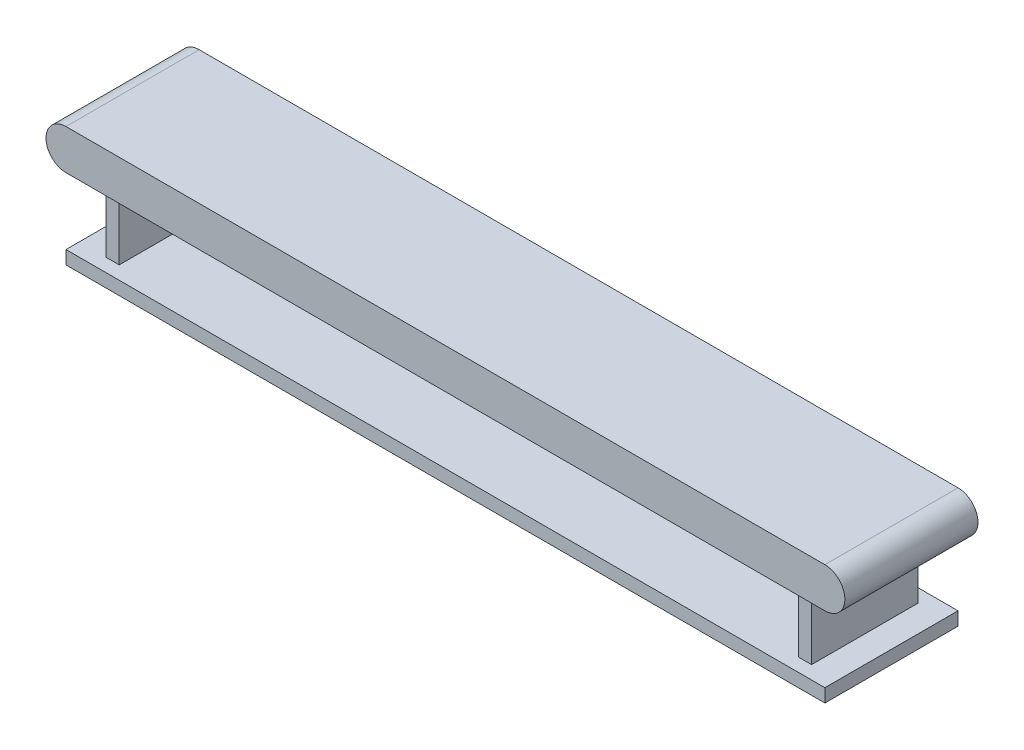
ISO-10303-21;
HEADER;
FILE_DESCRIPTION(('STEP AP214'),'2;1');
FILE_NAME('part.step','',(''),(''),'','','');
FILE_SCHEMA(('AUTOMOTIVE_DESIGN { 1 0 10303 214 1 1 1 1 }'));
ENDSEC;
DATA;
#1=APPLICATION_CONTEXT('core data for automotive mechanical design processes');
#2=APPLICATION_PROTOCOL_DEFINITION('international standard','automotive_design',2000,#1);
#3=PRODUCT_CONTEXT('',#1,'mechanical');
#4=PRODUCT('Part','Part','',(#3));
#5=PRODUCT_RELATED_PRODUCT_CATEGORY('part','',(#4));
#6=PRODUCT_DEFINITION_FORMATION('','',#4);
#7=PRODUCT_DEFINITION_CONTEXT('part definition',#1,'design');
#8=PRODUCT_DEFINITION('design','',#6,#7);
#9=PRODUCT_DEFINITION_SHAPE('','',#8);
#10=(LENGTH_UNIT() NAMED_UNIT(*) SI_UNIT(.MILLI.,.METRE.));
#11=(NAMED_UNIT(*) PLANE_ANGLE_UNIT() SI_UNIT($,.RADIAN.));
#12=(NAMED_UNIT(*) SI_UNIT($,.STERADIAN.) SOLID_ANGLE_UNIT());
#13=UNCERTAINTY_MEASURE_WITH_UNIT(LENGTH_MEASURE(1.E-05),#10,'distance_accuracy_value','');
#14=(GEOMETRIC_REPRESENTATION_CONTEXT(3) GLOBAL_UNCERTAINTY_ASSIGNED_CONTEXT((#13)) GLOBAL_UNIT_ASSIGNED_CONTEXT((#10,
#11,#12)) REPRESENTATION_CONTEXT('',''));
#15=CARTESIAN_POINT('',(0.,0.,0.));
#16=DIRECTION('',(0.,0.,1.));
#17=DIRECTION('',(1.,0.,0.));
#18=AXIS2_PLACEMENT_3D('',#15,#16,#17);
#19=CARTESIAN_POINT('',(0.,0.,0.));
#20=DIRECTION('',(0.,-1.,0.));
#21=DIRECTION('',(0.,0.,-1.));
#22=AXIS2_PLACEMENT_3D('',#19,#20,#21);
#23=PLANE('',#22);
#24=DIRECTION('',(1.,0.,0.));
#25=VECTOR('',#24,1.);
#26=CARTESIAN_POINT('',(-2650.,0.,400.));
#27=LINE('',#26,#25);
#28=CARTESIAN_POINT('',(-2650.,0.,400.));
#29=VERTEX_POINT('',#28);
#30=CARTESIAN_POINT('',(-2550.,0.,400.));
#31=VERTEX_POINT('',#30);
#32=EDGE_CURVE('E231',#29,#31,#27,.T.);
#33=ORIENTED_EDGE('',*,*,#32,.T.);
#34=DIRECTION('',(0.,0.,1.));
#35=VECTOR('',#34,1.);
#36=CARTESIAN_POINT('',(-2550.,0.,-400.));
#37=LINE('',#36,#35);
#38=CARTESIAN_POINT('',(-2550.,0.,-400.));
#39=VERTEX_POINT('',#38);
#40=EDGE_CURVE('E255',#39,#31,#37,.T.);
#41=ORIENTED_EDGE('',*,*,#40,.F.);
#42=DIRECTION('',(1.,0.,0.));
#43=VECTOR('',#42,1.);
#44=CARTESIAN_POINT('',(-2650.,0.,-400.));
#45=LINE('',#44,#43);
#46=CARTESIAN_POINT('',(-2650.,0.,-400.));
#47=VERTEX_POINT('',#46);
#48=EDGE_CURVE('E258',#47,#39,#45,.T.);
#49=ORIENTED_EDGE('',*,*,#48,.F.);
#50=DIRECTION('',(0.,0.,1.));
#51=VECTOR('',#50,1.);
#52=CARTESIAN_POINT('',(-2650.,0.,-400.));
#53=LINE('',#52,#51);
#54=EDGE_CURVE('E243',#47,#29,#53,.T.);
#55=ORIENTED_EDGE('',*,*,#54,.T.);
#56=EDGE_LOOP('',(#33,#41,#49,#55));
#57=FACE_BOUND('',#56,.T.);
#58=DIRECTION('',(-1.,0.,0.));
#59=VECTOR('',#58,1.);
#60=CARTESIAN_POINT('',(-3000.,0.,-500.));
#61=LINE('',#60,#59);
#62=CARTESIAN_POINT('',(2850.,0.,-500.));
#63=VERTEX_POINT('',#62);
#64=CARTESIAN_POINT('',(-2850.,0.,-500.));
#65=VERTEX_POINT('',#64);
#66=EDGE_CURVE('E286',#63,#65,#61,.T.);
#67=ORIENTED_EDGE('',*,*,#66,.F.);
#68=DIRECTION('',(0.,0.,1.));
#69=VECTOR('',#68,1.);
#70=CARTESIAN_POINT('',(2850.,0.,-500.));
#71=LINE('',#70,#69);
#72=CARTESIAN_POINT('',(2850.,0.,500.));
#73=VERTEX_POINT('',#72);
#74=EDGE_CURVE('E271',#63,#73,#71,.T.);
#75=ORIENTED_EDGE('',*,*,#74,.T.);
#76=DIRECTION('',(1.,0.,0.));
#77=VECTOR('',#76,1.);
#78=CARTESIAN_POINT('',(-3000.,0.,500.));
#79=LINE('',#78,#77);
#80=CARTESIAN_POINT('',(-2850.,0.,500.));
#81=VERTEX_POINT('',#80);
#82=EDGE_CURVE('E73',#81,#73,#79,.T.);
#83=ORIENTED_EDGE('',*,*,#82,.F.);
#84=DIRECTION('',(0.,0.,1.));
#85=VECTOR('',#84,1.);
#86=CARTESIAN_POINT('',(-2850.,0.,-500.));
#87=LINE('',#86,#85);
#88=EDGE_CURVE('E283',#65,#81,#87,.T.);
#89=ORIENTED_EDGE('',*,*,#88,.F.);
#90=EDGE_LOOP('',(#67,#75,#83,#89));
#91=FACE_BOUND('',#90,.T.);
#92=DIRECTION('',(-1.,0.,0.));
#93=VECTOR('',#92,1.);
#94=CARTESIAN_POINT('',(2650.,0.,400.));
#95=LINE('',#94,#93);
#96=CARTESIAN_POINT('',(2650.,0.,400.));
#97=VERTEX_POINT('',#96);
#98=CARTESIAN_POINT('',(2550.,0.,400.));
#99=VERTEX_POINT('',#98);
#100=EDGE_CURVE('E86',#97,#99,#95,.T.);
#101=ORIENTED_EDGE('',*,*,#100,.F.);
#102=DIRECTION('',(0.,0.,1.));
#103=VECTOR('',#102,1.);
#104=CARTESIAN_POINT('',(2650.,0.,-400.));
#105=LINE('',#104,#103);
#106=CARTESIAN_POINT('',(2650.,0.,-400.));
#107=VERTEX_POINT('',#106);
#108=EDGE_CURVE('E228',#107,#97,#105,.T.);
#109=ORIENTED_EDGE('',*,*,#108,.F.);
#110=DIRECTION('',(-1.,0.,0.));
#111=VECTOR('',#110,1.);
#112=CARTESIAN_POINT('',(2650.,0.,-400.));
#113=LINE('',#112,#111);
#114=CARTESIAN_POINT('',(2550.,0.,-400.));
#115=VERTEX_POINT('',#114);
#116=EDGE_CURVE('E223',#107,#115,#113,.T.);
#117=ORIENTED_EDGE('',*,*,#116,.T.);
#118=DIRECTION('',(0.,0.,1.));
#119=VECTOR('',#118,1.);
#120=CARTESIAN_POINT('',(2550.,0.,-400.));
#121=LINE('',#120,#119);
#122=EDGE_CURVE('E91',#115,#99,#121,.T.);
#123=ORIENTED_EDGE('',*,*,#122,.T.);
#124=EDGE_LOOP('',(#101,#109,#117,#123));
#125=FACE_BOUND('',#124,.T.);
#126=ADVANCED_FACE('F69',(#57,#91,#125),#23,.T.);
#127=CARTESIAN_POINT('',(-3000.,300.,-500.));
#128=DIRECTION('',(0.,0.,1.));
#129=DIRECTION('',(1.,0.,0.));
#130=AXIS2_PLACEMENT_3D('',#127,#128,#129);
#131=PLANE('',#130);
#132=CARTESIAN_POINT('',(2850.,150.,-500.));
#133=DIRECTION('',(0.,0.,1.));
#134=DIRECTION('',(1.,0.,0.));
#135=AXIS2_PLACEMENT_3D('',#132,#133,#134);
#136=CIRCLE('',#135,150.);
#137=CARTESIAN_POINT('',(2850.,300.,-500.));
#138=VERTEX_POINT('',#137);
#139=EDGE_CURVE('E277',#63,#138,#136,.T.);
#140=ORIENTED_EDGE('',*,*,#139,.F.);
#141=ORIENTED_EDGE('',*,*,#66,.T.);
#142=CARTESIAN_POINT('',(-2850.,150.,-500.));
#143=DIRECTION('',(0.,0.,1.));
#144=DIRECTION('',(1.,0.,0.));
#145=AXIS2_PLACEMENT_3D('',#142,#143,#144);
#146=CIRCLE('',#145,150.);
#147=CARTESIAN_POINT('',(-2850.,300.,-500.));
#148=VERTEX_POINT('',#147);
#149=EDGE_CURVE('E287',#148,#65,#146,.T.);
#150=ORIENTED_EDGE('',*,*,#149,.F.);
#151=DIRECTION('',(-1.,0.,0.));
#152=VECTOR('',#151,1.);
#153=CARTESIAN_POINT('',(-3000.,300.,-500.));
#154=LINE('',#153,#152);
#155=EDGE_CURVE('E78',#138,#148,#154,.T.);
#156=ORIENTED_EDGE('',*,*,#155,.F.);
#157=EDGE_LOOP('',(#140,#141,#150,#156));
#158=FACE_BOUND('',#157,.T.);
#159=ADVANCED_FACE('F71',(#158),#131,.F.);
#160=CARTESIAN_POINT('',(-3000.,300.,500.));
#161=DIRECTION('',(0.,0.,-1.));
#162=DIRECTION('',(-1.,0.,0.));
#163=AXIS2_PLACEMENT_3D('',#160,#161,#162);
#164=PLANE('',#163);
#165=ORIENTED_EDGE('',*,*,#82,.T.);
#166=CARTESIAN_POINT('',(2850.,150.,500.));
#167=DIRECTION('',(0.,0.,1.));
#168=DIRECTION('',(1.,0.,0.));
#169=AXIS2_PLACEMENT_3D('',#166,#167,#168);
#170=CIRCLE('',#169,150.);
#171=CARTESIAN_POINT('',(2850.,300.,500.));
#172=VERTEX_POINT('',#171);
#173=EDGE_CURVE('E280',#73,#172,#170,.T.);
#174=ORIENTED_EDGE('',*,*,#173,.T.);
#175=DIRECTION('',(1.,0.,0.));
#176=VECTOR('',#175,1.);
#177=CARTESIAN_POINT('',(-3000.,300.,500.));
#178=LINE('',#177,#176);
#179=CARTESIAN_POINT('',(-2850.,300.,500.));
#180=VERTEX_POINT('',#179);
#181=EDGE_CURVE('E12',#180,#172,#178,.T.);
#182=ORIENTED_EDGE('',*,*,#181,.F.);
#183=CARTESIAN_POINT('',(-2850.,150.,500.));
#184=DIRECTION('',(0.,0.,1.));
#185=DIRECTION('',(1.,0.,0.));
#186=AXIS2_PLACEMENT_3D('',#183,#184,#185);
#187=CIRCLE('',#186,150.);
#188=EDGE_CURVE('E274',#180,#81,#187,.T.);
#189=ORIENTED_EDGE('',*,*,#188,.T.);
#190=EDGE_LOOP('',(#165,#174,#182,#189));
#191=FACE_BOUND('',#190,.T.);
#192=ADVANCED_FACE('F299',(#191),#164,.F.);
#193=CARTESIAN_POINT('',(0.,300.,0.));
#194=DIRECTION('',(0.,-1.,0.));
#195=DIRECTION('',(0.,0.,-1.));
#196=AXIS2_PLACEMENT_3D('',#193,#194,#195);
#197=PLANE('',#196);
#198=ORIENTED_EDGE('',*,*,#155,.T.);
#199=DIRECTION('',(0.,0.,1.));
#200=VECTOR('',#199,1.);
#201=CARTESIAN_POINT('',(-2850.,300.,-500.));
#202=LINE('',#201,#200);
#203=EDGE_CURVE('E265',#148,#180,#202,.T.);
#204=ORIENTED_EDGE('',*,*,#203,.T.);
#205=ORIENTED_EDGE('',*,*,#181,.T.);
#206=DIRECTION('',(0.,0.,1.));
#207=VECTOR('',#206,1.);
#208=CARTESIAN_POINT('',(2850.,300.,-500.));
#209=LINE('',#208,#207);
#210=EDGE_CURVE('E279',#138,#172,#209,.T.);
#211=ORIENTED_EDGE('',*,*,#210,.F.);
#212=EDGE_LOOP('',(#198,#204,#205,#211));
#213=FACE_BOUND('',#212,.T.);
#214=ADVANCED_FACE('F309',(#213),#197,.F.);
#215=CARTESIAN_POINT('',(-2850.,150.,-500.));
#216=DIRECTION('',(0.,0.,1.));
#217=DIRECTION('',(1.,0.,0.));
#218=AXIS2_PLACEMENT_3D('',#215,#216,#217);
#219=CYLINDRICAL_SURFACE('',#218,150.);
#220=ORIENTED_EDGE('',*,*,#188,.F.);
#221=ORIENTED_EDGE('',*,*,#203,.F.);
#222=ORIENTED_EDGE('',*,*,#149,.T.);
#223=ORIENTED_EDGE('',*,*,#88,.T.);
#224=EDGE_LOOP('',(#220,#221,#222,#223));
#225=FACE_BOUND('',#224,.T.);
#226=ADVANCED_FACE('F312',(#225),#219,.T.);
#227=CARTESIAN_POINT('',(2850.,150.,-500.));
#228=DIRECTION('',(0.,0.,1.));
#229=DIRECTION('',(1.,0.,0.));
#230=AXIS2_PLACEMENT_3D('',#227,#228,#229);
#231=CYLINDRICAL_SURFACE('',#230,150.);
#232=ORIENTED_EDGE('',*,*,#173,.F.);
#233=ORIENTED_EDGE('',*,*,#74,.F.);
#234=ORIENTED_EDGE('',*,*,#139,.T.);
#235=ORIENTED_EDGE('',*,*,#210,.T.);
#236=EDGE_LOOP('',(#232,#233,#234,#235));
#237=FACE_BOUND('',#236,.T.);
#238=ADVANCED_FACE('F305',(#237),#231,.T.);
#239=CARTESIAN_POINT('',(-2650.,-500.,400.));
#240=DIRECTION('',(0.,0.,1.));
#241=DIRECTION('',(1.,0.,0.));
#242=AXIS2_PLACEMENT_3D('',#239,#240,#241);
#243=PLANE('',#242);
#244=ORIENTED_EDGE('',*,*,#32,.F.);
#245=DIRECTION('',(0.,1.,0.));
#246=VECTOR('',#245,1.);
#247=CARTESIAN_POINT('',(-2650.,-500.,400.));
#248=LINE('',#247,#246);
#249=CARTESIAN_POINT('',(-2650.,-500.,400.));
#250=VERTEX_POINT('',#249);
#251=EDGE_CURVE('E263',#250,#29,#248,.T.);
#252=ORIENTED_EDGE('',*,*,#251,.F.);
#253=DIRECTION('',(1.,0.,0.));
#254=VECTOR('',#253,1.);
#255=CARTESIAN_POINT('',(-2650.,-500.,400.));
#256=LINE('',#255,#254);
#257=CARTESIAN_POINT('',(-2550.,-500.,400.));
#258=VERTEX_POINT('',#257);
#259=EDGE_CURVE('E240',#250,#258,#256,.T.);
#260=ORIENTED_EDGE('',*,*,#259,.T.);
#261=DIRECTION('',(0.,1.,0.));
#262=VECTOR('',#261,1.);
#263=CARTESIAN_POINT('',(-2550.,-500.,400.));
#264=LINE('',#263,#262);
#265=EDGE_CURVE('E252',#258,#31,#264,.T.);
#266=ORIENTED_EDGE('',*,*,#265,.T.);
#267=EDGE_LOOP('',(#244,#252,#260,#266));
#268=FACE_BOUND('',#267,.T.);
#269=ADVANCED_FACE('F319',(#268),#243,.T.);
#270=CARTESIAN_POINT('',(-2650.,-500.,-400.));
#271=DIRECTION('',(-1.,0.,0.));
#272=DIRECTION('',(0.,0.,1.));
#273=AXIS2_PLACEMENT_3D('',#270,#271,#272);
#274=PLANE('',#273);
#275=ORIENTED_EDGE('',*,*,#54,.F.);
#276=DIRECTION('',(0.,1.,0.));
#277=VECTOR('',#276,1.);
#278=CARTESIAN_POINT('',(-2650.,-500.,-400.));
#279=LINE('',#278,#277);
#280=CARTESIAN_POINT('',(-2650.,-500.,-400.));
#281=VERTEX_POINT('',#280);
#282=EDGE_CURVE('E266',#281,#47,#279,.T.);
#283=ORIENTED_EDGE('',*,*,#282,.F.);
#284=DIRECTION('',(0.,0.,1.));
#285=VECTOR('',#284,1.);
#286=CARTESIAN_POINT('',(-2650.,-500.,-400.));
#287=LINE('',#286,#285);
#288=EDGE_CURVE('E249',#281,#250,#287,.T.);
#289=ORIENTED_EDGE('',*,*,#288,.T.);
#290=ORIENTED_EDGE('',*,*,#251,.T.);
#291=EDGE_LOOP('',(#275,#283,#289,#290));
#292=FACE_BOUND('',#291,.T.);
#293=ADVANCED_FACE('F357',(#292),#274,.T.);
#294=CARTESIAN_POINT('',(-2650.,-500.,-400.));
#295=DIRECTION('',(0.,0.,1.));
#296=DIRECTION('',(1.,0.,0.));
#297=AXIS2_PLACEMENT_3D('',#294,#295,#296);
#298=PLANE('',#297);
#299=ORIENTED_EDGE('',*,*,#48,.T.);
#300=DIRECTION('',(0.,1.,0.));
#301=VECTOR('',#300,1.);
#302=CARTESIAN_POINT('',(-2550.,-500.,-400.));
#303=LINE('',#302,#301);
#304=CARTESIAN_POINT('',(-2550.,-500.,-400.));
#305=VERTEX_POINT('',#304);
#306=EDGE_CURVE('E268',#305,#39,#303,.T.);
#307=ORIENTED_EDGE('',*,*,#306,.F.);
#308=DIRECTION('',(1.,0.,0.));
#309=VECTOR('',#308,1.);
#310=CARTESIAN_POINT('',(-2650.,-500.,-400.));
#311=LINE('',#310,#309);
#312=EDGE_CURVE('E246',#281,#305,#311,.T.);
#313=ORIENTED_EDGE('',*,*,#312,.F.);
#314=ORIENTED_EDGE('',*,*,#282,.T.);
#315=EDGE_LOOP('',(#299,#307,#313,#314));
#316=FACE_BOUND('',#315,.T.);
#317=ADVANCED_FACE('F365',(#316),#298,.F.);
#318=CARTESIAN_POINT('',(-2550.,-500.,-400.));
#319=DIRECTION('',(-1.,0.,0.));
#320=DIRECTION('',(0.,0.,1.));
#321=AXIS2_PLACEMENT_3D('',#318,#319,#320);
#322=PLANE('',#321);
#323=ORIENTED_EDGE('',*,*,#40,.T.);
#324=ORIENTED_EDGE('',*,*,#265,.F.);
#325=DIRECTION('',(0.,0.,1.));
#326=VECTOR('',#325,1.);
#327=CARTESIAN_POINT('',(-2550.,-500.,-400.));
#328=LINE('',#327,#326);
#329=EDGE_CURVE('E242',#305,#258,#328,.T.);
#330=ORIENTED_EDGE('',*,*,#329,.F.);
#331=ORIENTED_EDGE('',*,*,#306,.T.);
#332=EDGE_LOOP('',(#323,#324,#330,#331));
#333=FACE_BOUND('',#332,.T.);
#334=ADVANCED_FACE('F373',(#333),#322,.F.);
#335=CARTESIAN_POINT('',(2650.,-500.,-400.));
#336=DIRECTION('',(-1.,0.,0.));
#337=DIRECTION('',(0.,0.,1.));
#338=AXIS2_PLACEMENT_3D('',#335,#336,#337);
#339=PLANE('',#338);
#340=ORIENTED_EDGE('',*,*,#108,.T.);
#341=DIRECTION('',(0.,1.,0.));
#342=VECTOR('',#341,1.);
#343=CARTESIAN_POINT('',(2650.,-500.,400.));
#344=LINE('',#343,#342);
#345=CARTESIAN_POINT('',(2650.,-500.,400.));
#346=VERTEX_POINT('',#345);
#347=EDGE_CURVE('E207',#346,#97,#344,.T.);
#348=ORIENTED_EDGE('',*,*,#347,.F.);
#349=DIRECTION('',(0.,0.,1.));
#350=VECTOR('',#349,1.);
#351=CARTESIAN_POINT('',(2650.,-500.,-400.));
#352=LINE('',#351,#350);
#353=CARTESIAN_POINT('',(2650.,-500.,-400.));
#354=VERTEX_POINT('',#353);
#355=EDGE_CURVE('E225',#354,#346,#352,.T.);
#356=ORIENTED_EDGE('',*,*,#355,.F.);
#357=DIRECTION('',(0.,1.,0.));
#358=VECTOR('',#357,1.);
#359=CARTESIAN_POINT('',(2650.,-500.,-400.));
#360=LINE('',#359,#358);
#361=EDGE_CURVE('E219',#354,#107,#360,.T.);
#362=ORIENTED_EDGE('',*,*,#361,.T.);
#363=EDGE_LOOP('',(#340,#348,#356,#362));
#364=FACE_BOUND('',#363,.T.);
#365=ADVANCED_FACE('F381',(#364),#339,.F.);
#366=CARTESIAN_POINT('',(2650.,-500.,400.));
#367=DIRECTION('',(0.,0.,-1.));
#368=DIRECTION('',(-1.,0.,0.));
#369=AXIS2_PLACEMENT_3D('',#366,#367,#368);
#370=PLANE('',#369);
#371=ORIENTED_EDGE('',*,*,#100,.T.);
#372=DIRECTION('',(0.,1.,0.));
#373=VECTOR('',#372,1.);
#374=CARTESIAN_POINT('',(2550.,-500.,400.));
#375=LINE('',#374,#373);
#376=CARTESIAN_POINT('',(2550.,-500.,400.));
#377=VERTEX_POINT('',#376);
#378=EDGE_CURVE('E209',#377,#99,#375,.T.);
#379=ORIENTED_EDGE('',*,*,#378,.F.);
#380=DIRECTION('',(-1.,0.,0.));
#381=VECTOR('',#380,1.);
#382=CARTESIAN_POINT('',(2650.,-500.,400.));
#383=LINE('',#382,#381);
#384=EDGE_CURVE('E237',#346,#377,#383,.T.);
#385=ORIENTED_EDGE('',*,*,#384,.F.);
#386=ORIENTED_EDGE('',*,*,#347,.T.);
#387=EDGE_LOOP('',(#371,#379,#385,#386));
#388=FACE_BOUND('',#387,.T.);
#389=ADVANCED_FACE('F389',(#388),#370,.F.);
#390=CARTESIAN_POINT('',(2550.,-500.,-400.));
#391=DIRECTION('',(-1.,0.,0.));
#392=DIRECTION('',(0.,0.,1.));
#393=AXIS2_PLACEMENT_3D('',#390,#391,#392);
#394=PLANE('',#393);
#395=ORIENTED_EDGE('',*,*,#122,.F.);
#396=DIRECTION('',(0.,1.,0.));
#397=VECTOR('',#396,1.);
#398=CARTESIAN_POINT('',(2550.,-500.,-400.));
#399=LINE('',#398,#397);
#400=CARTESIAN_POINT('',(2550.,-500.,-400.));
#401=VERTEX_POINT('',#400);
#402=EDGE_CURVE('E216',#401,#115,#399,.T.);
#403=ORIENTED_EDGE('',*,*,#402,.F.);
#404=DIRECTION('',(0.,0.,1.));
#405=VECTOR('',#404,1.);
#406=CARTESIAN_POINT('',(2550.,-500.,-400.));
#407=LINE('',#406,#405);
#408=EDGE_CURVE('E234',#401,#377,#407,.T.);
#409=ORIENTED_EDGE('',*,*,#408,.T.);
#410=ORIENTED_EDGE('',*,*,#378,.T.);
#411=EDGE_LOOP('',(#395,#403,#409,#410));
#412=FACE_BOUND('',#411,.T.);
#413=ADVANCED_FACE('F397',(#412),#394,.T.);
#414=CARTESIAN_POINT('',(2650.,-500.,-400.));
#415=DIRECTION('',(0.,0.,-1.));
#416=DIRECTION('',(-1.,0.,0.));
#417=AXIS2_PLACEMENT_3D('',#414,#415,#416);
#418=PLANE('',#417);
#419=ORIENTED_EDGE('',*,*,#116,.F.);
#420=ORIENTED_EDGE('',*,*,#361,.F.);
#421=DIRECTION('',(-1.,0.,0.));
#422=VECTOR('',#421,1.);
#423=CARTESIAN_POINT('',(2650.,-500.,-400.));
#424=LINE('',#423,#422);
#425=EDGE_CURVE('E222',#354,#401,#424,.T.);
#426=ORIENTED_EDGE('',*,*,#425,.T.);
#427=ORIENTED_EDGE('',*,*,#402,.T.);
#428=EDGE_LOOP('',(#419,#420,#426,#427));
#429=FACE_BOUND('',#428,.T.);
#430=ADVANCED_FACE('F405',(#429),#418,.T.);
#431=CARTESIAN_POINT('',(0.,-500.,0.));
#432=DIRECTION('',(0.,-1.,0.));
#433=DIRECTION('',(0.,0.,-1.));
#434=AXIS2_PLACEMENT_3D('',#431,#432,#433);
#435=PLANE('',#434);
#436=ORIENTED_EDGE('',*,*,#259,.F.);
#437=ORIENTED_EDGE('',*,*,#288,.F.);
#438=ORIENTED_EDGE('',*,*,#312,.T.);
#439=ORIENTED_EDGE('',*,*,#329,.T.);
#440=EDGE_LOOP('',(#436,#437,#438,#439));
#441=FACE_BOUND('',#440,.T.);
#442=DIRECTION('',(0.,0.,-1.));
#443=VECTOR('',#442,1.);
#444=CARTESIAN_POINT('',(-2850.,-500.,-500.));
#445=LINE('',#444,#443);
#446=CARTESIAN_POINT('',(-2850.,-500.,500.));
#447=VERTEX_POINT('',#446);
#448=CARTESIAN_POINT('',(-2850.,-500.,-500.));
#449=VERTEX_POINT('',#448);
#450=EDGE_CURVE('E206',#447,#449,#445,.T.);
#451=ORIENTED_EDGE('',*,*,#450,.F.);
#452=DIRECTION('',(-1.,0.,0.));
#453=VECTOR('',#452,1.);
#454=CARTESIAN_POINT('',(2850.,-500.,500.));
#455=LINE('',#454,#453);
#456=CARTESIAN_POINT('',(2850.,-500.,500.));
#457=VERTEX_POINT('',#456);
#458=EDGE_CURVE('E202',#457,#447,#455,.T.);
#459=ORIENTED_EDGE('',*,*,#458,.F.);
#460=DIRECTION('',(0.,0.,1.));
#461=VECTOR('',#460,1.);
#462=CARTESIAN_POINT('',(2850.,-500.,-500.));
#463=LINE('',#462,#461);
#464=CARTESIAN_POINT('',(2850.,-500.,-500.));
#465=VERTEX_POINT('',#464);
#466=EDGE_CURVE('E503',#465,#457,#463,.T.);
#467=ORIENTED_EDGE('',*,*,#466,.F.);
#468=DIRECTION('',(1.,0.,0.));
#469=VECTOR('',#468,1.);
#470=CARTESIAN_POINT('',(2850.,-500.,-500.));
#471=LINE('',#470,#469);
#472=EDGE_CURVE('E507',#449,#465,#471,.T.);
#473=ORIENTED_EDGE('',*,*,#472,.F.);
#474=EDGE_LOOP('',(#451,#459,#467,#473));
#475=FACE_BOUND('',#474,.T.);
#476=ORIENTED_EDGE('',*,*,#425,.F.);
#477=ORIENTED_EDGE('',*,*,#355,.T.);
#478=ORIENTED_EDGE('',*,*,#384,.T.);
#479=ORIENTED_EDGE('',*,*,#408,.F.);
#480=EDGE_LOOP('',(#476,#477,#478,#479));
#481=FACE_BOUND('',#480,.T.);
#482=ADVANCED_FACE('F413',(#441,#475,#481),#435,.F.);
#483=CARTESIAN_POINT('',(-2850.,-600.,-500.));
#484=DIRECTION('',(1.,0.,0.));
#485=DIRECTION('',(0.,0.,-1.));
#486=AXIS2_PLACEMENT_3D('',#483,#484,#485);
#487=PLANE('',#486);
#488=ORIENTED_EDGE('',*,*,#450,.T.);
#489=DIRECTION('',(0.,1.,0.));
#490=VECTOR('',#489,1.);
#491=CARTESIAN_POINT('',(-2850.,-600.,-500.));
#492=LINE('',#491,#490);
#493=CARTESIAN_POINT('',(-2850.,-600.,-500.));
#494=VERTEX_POINT('',#493);
#495=EDGE_CURVE('E186',#494,#449,#492,.T.);
#496=ORIENTED_EDGE('',*,*,#495,.F.);
#497=DIRECTION('',(0.,0.,-1.));
#498=VECTOR('',#497,1.);
#499=CARTESIAN_POINT('',(-2850.,-600.,-500.));
#500=LINE('',#499,#498);
#501=CARTESIAN_POINT('',(-2850.,-600.,500.));
#502=VERTEX_POINT('',#501);
#503=EDGE_CURVE('E193',#502,#494,#500,.T.);
#504=ORIENTED_EDGE('',*,*,#503,.F.);
#505=DIRECTION('',(0.,1.,0.));
#506=VECTOR('',#505,1.);
#507=CARTESIAN_POINT('',(-2850.,-600.,500.));
#508=LINE('',#507,#506);
#509=EDGE_CURVE('E499',#502,#447,#508,.T.);
#510=ORIENTED_EDGE('',*,*,#509,.T.);
#511=EDGE_LOOP('',(#488,#496,#504,#510));
#512=FACE_BOUND('',#511,.T.);
#513=ADVANCED_FACE('F204',(#512),#487,.F.);
#514=CARTESIAN_POINT('',(2850.,-600.,-500.));
#515=DIRECTION('',(0.,0.,1.));
#516=DIRECTION('',(1.,0.,0.));
#517=AXIS2_PLACEMENT_3D('',#514,#515,#516);
#518=PLANE('',#517);
#519=ORIENTED_EDGE('',*,*,#472,.T.);
#520=DIRECTION('',(0.,1.,0.));
#521=VECTOR('',#520,1.);
#522=CARTESIAN_POINT('',(2850.,-600.,-500.));
#523=LINE('',#522,#521);
#524=CARTESIAN_POINT('',(2850.,-600.,-500.));
#525=VERTEX_POINT('',#524);
#526=EDGE_CURVE('E189',#525,#465,#523,.T.);
#527=ORIENTED_EDGE('',*,*,#526,.F.);
#528=DIRECTION('',(1.,0.,0.));
#529=VECTOR('',#528,1.);
#530=CARTESIAN_POINT('',(2850.,-600.,-500.));
#531=LINE('',#530,#529);
#532=EDGE_CURVE('E182',#494,#525,#531,.T.);
#533=ORIENTED_EDGE('',*,*,#532,.F.);
#534=ORIENTED_EDGE('',*,*,#495,.T.);
#535=EDGE_LOOP('',(#519,#527,#533,#534));
#536=FACE_BOUND('',#535,.T.);
#537=ADVANCED_FACE('F184',(#536),#518,.F.);
#538=CARTESIAN_POINT('',(2850.,-600.,-500.));
#539=DIRECTION('',(-1.,0.,0.));
#540=DIRECTION('',(0.,0.,1.));
#541=AXIS2_PLACEMENT_3D('',#538,#539,#540);
#542=PLANE('',#541);
#543=ORIENTED_EDGE('',*,*,#466,.T.);
#544=DIRECTION('',(0.,1.,0.));
#545=VECTOR('',#544,1.);
#546=CARTESIAN_POINT('',(2850.,-600.,500.));
#547=LINE('',#546,#545);
#548=CARTESIAN_POINT('',(2850.,-600.,500.));
#549=VERTEX_POINT('',#548);
#550=EDGE_CURVE('E211',#549,#457,#547,.T.);
#551=ORIENTED_EDGE('',*,*,#550,.F.);
#552=DIRECTION('',(0.,0.,1.));
#553=VECTOR('',#552,1.);
#554=CARTESIAN_POINT('',(2850.,-600.,-500.));
#555=LINE('',#554,#553);
#556=EDGE_CURVE('E192',#525,#549,#555,.T.);
#557=ORIENTED_EDGE('',*,*,#556,.F.);
#558=ORIENTED_EDGE('',*,*,#526,.T.);
#559=EDGE_LOOP('',(#543,#551,#557,#558));
#560=FACE_BOUND('',#559,.T.);
#561=ADVANCED_FACE('F434',(#560),#542,.F.);
#562=CARTESIAN_POINT('',(2850.,-600.,500.));
#563=DIRECTION('',(0.,0.,-1.));
#564=DIRECTION('',(-1.,0.,0.));
#565=AXIS2_PLACEMENT_3D('',#562,#563,#564);
#566=PLANE('',#565);
#567=ORIENTED_EDGE('',*,*,#458,.T.);
#568=ORIENTED_EDGE('',*,*,#509,.F.);
#569=DIRECTION('',(-1.,0.,0.));
#570=VECTOR('',#569,1.);
#571=CARTESIAN_POINT('',(2850.,-600.,500.));
#572=LINE('',#571,#570);
#573=EDGE_CURVE('E198',#549,#502,#572,.T.);
#574=ORIENTED_EDGE('',*,*,#573,.F.);
#575=ORIENTED_EDGE('',*,*,#550,.T.);
#576=EDGE_LOOP('',(#567,#568,#574,#575));
#577=FACE_BOUND('',#576,.T.);
#578=ADVANCED_FACE('F441',(#577),#566,.F.);
#579=CARTESIAN_POINT('',(0.,-600.,0.));
#580=DIRECTION('',(0.,-1.,0.));
#581=DIRECTION('',(0.,0.,-1.));
#582=AXIS2_PLACEMENT_3D('',#579,#580,#581);
#583=PLANE('',#582);
#584=ORIENTED_EDGE('',*,*,#503,.T.);
#585=ORIENTED_EDGE('',*,*,#532,.T.);
#586=ORIENTED_EDGE('',*,*,#556,.T.);
#587=ORIENTED_EDGE('',*,*,#573,.T.);
#588=EDGE_LOOP('',(#584,#585,#586,#587));
#589=FACE_BOUND('',#588,.T.);
#590=ADVANCED_FACE('F196',(#589),#583,.T.);
#591=CLOSED_SHELL('',(#126,#159,#192,#214,#226,#238,#269,#293,#317,#334,#365,#389,#413,#430,
#482,#513,#537,#561,#578,#590));
#592=MANIFOLD_SOLID_BREP('B2',#591);
#593=ADVANCED_BREP_SHAPE_REPRESENTATION('',(#18,#592),#14);
#594=SHAPE_DEFINITION_REPRESENTATION(#9,#593);
ENDSEC;
END-ISO-10303-21;
